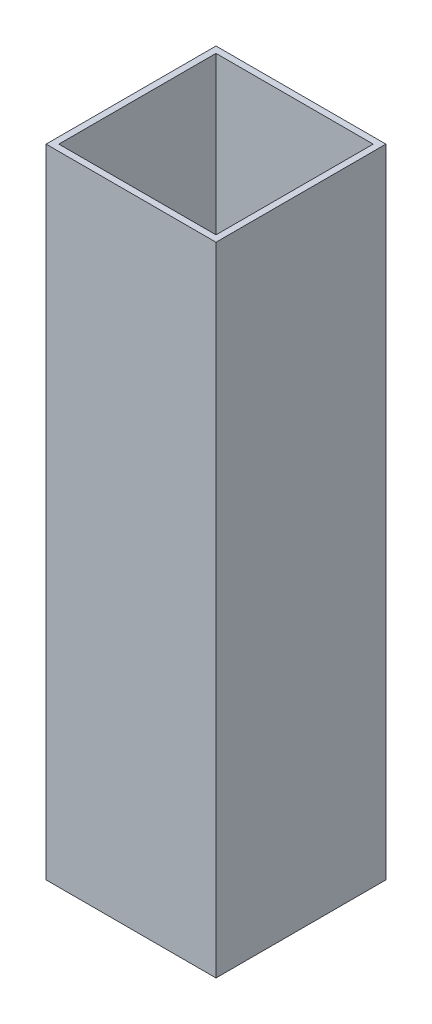
ISO-10303-21;
HEADER;
FILE_DESCRIPTION(('STEP AP214'),'2;1');
FILE_NAME('part.step','',(''),(''),'','','');
FILE_SCHEMA(('AUTOMOTIVE_DESIGN { 1 0 10303 214 1 1 1 1 }'));
ENDSEC;
DATA;
#1=APPLICATION_CONTEXT('core data for automotive mechanical design processes');
#2=APPLICATION_PROTOCOL_DEFINITION('international standard','automotive_design',2000,#1);
#3=PRODUCT_CONTEXT('',#1,'mechanical');
#4=PRODUCT('Part','Part','',(#3));
#5=PRODUCT_RELATED_PRODUCT_CATEGORY('part','',(#4));
#6=PRODUCT_DEFINITION_FORMATION('','',#4);
#7=PRODUCT_DEFINITION_CONTEXT('part definition',#1,'design');
#8=PRODUCT_DEFINITION('design','',#6,#7);
#9=PRODUCT_DEFINITION_SHAPE('','',#8);
#10=(LENGTH_UNIT() NAMED_UNIT(*) SI_UNIT(.MILLI.,.METRE.));
#11=(NAMED_UNIT(*) PLANE_ANGLE_UNIT() SI_UNIT($,.RADIAN.));
#12=(NAMED_UNIT(*) SI_UNIT($,.STERADIAN.) SOLID_ANGLE_UNIT());
#13=UNCERTAINTY_MEASURE_WITH_UNIT(LENGTH_MEASURE(1.E-05),#10,'distance_accuracy_value','');
#14=(GEOMETRIC_REPRESENTATION_CONTEXT(3) GLOBAL_UNCERTAINTY_ASSIGNED_CONTEXT((#13)) GLOBAL_UNIT_ASSIGNED_CONTEXT((#10,
#11,#12)) REPRESENTATION_CONTEXT('',''));
#15=CARTESIAN_POINT('',(0.,0.,0.));
#16=DIRECTION('',(0.,0.,1.));
#17=DIRECTION('',(1.,0.,0.));
#18=AXIS2_PLACEMENT_3D('',#15,#16,#17);
#19=CARTESIAN_POINT('',(20.,150.,20.));
#20=DIRECTION('',(-1.,0.,0.));
#21=DIRECTION('',(0.,0.,1.));
#22=AXIS2_PLACEMENT_3D('',#19,#20,#21);
#23=PLANE('',#22);
#24=DIRECTION('',(0.,0.,-1.));
#25=VECTOR('',#24,1.);
#26=CARTESIAN_POINT('',(20.,0.,20.));
#27=LINE('',#26,#25);
#28=CARTESIAN_POINT('',(20.,0.,20.));
#29=VERTEX_POINT('',#28);
#30=CARTESIAN_POINT('',(20.,0.,-20.));
#31=VERTEX_POINT('',#30);
#32=EDGE_CURVE('E147',#29,#31,#27,.T.);
#33=ORIENTED_EDGE('',*,*,#32,.T.);
#34=DIRECTION('',(0.,-1.,0.));
#35=VECTOR('',#34,1.);
#36=CARTESIAN_POINT('',(20.,150.,-20.));
#37=LINE('',#36,#35);
#38=CARTESIAN_POINT('',(20.,150.,-20.));
#39=VERTEX_POINT('',#38);
#40=EDGE_CURVE('E11',#39,#31,#37,.T.);
#41=ORIENTED_EDGE('',*,*,#40,.F.);
#42=DIRECTION('',(0.,0.,-1.));
#43=VECTOR('',#42,1.);
#44=CARTESIAN_POINT('',(20.,150.,20.));
#45=LINE('',#44,#43);
#46=CARTESIAN_POINT('',(20.,150.,20.));
#47=VERTEX_POINT('',#46);
#48=EDGE_CURVE('E153',#47,#39,#45,.T.);
#49=ORIENTED_EDGE('',*,*,#48,.F.);
#50=DIRECTION('',(0.,-1.,0.));
#51=VECTOR('',#50,1.);
#52=CARTESIAN_POINT('',(20.,150.,20.));
#53=LINE('',#52,#51);
#54=EDGE_CURVE('E167',#47,#29,#53,.T.);
#55=ORIENTED_EDGE('',*,*,#54,.T.);
#56=EDGE_LOOP('',(#33,#41,#49,#55));
#57=FACE_BOUND('',#56,.T.);
#58=ADVANCED_FACE('F39',(#57),#23,.F.);
#59=CARTESIAN_POINT('',(-20.,150.,-20.));
#60=DIRECTION('',(0.,0.,1.));
#61=DIRECTION('',(1.,0.,0.));
#62=AXIS2_PLACEMENT_3D('',#59,#60,#61);
#63=PLANE('',#62);
#64=DIRECTION('',(-1.,0.,0.));
#65=VECTOR('',#64,1.);
#66=CARTESIAN_POINT('',(-20.,0.,-20.));
#67=LINE('',#66,#65);
#68=CARTESIAN_POINT('',(-20.,0.,-20.));
#69=VERTEX_POINT('',#68);
#70=EDGE_CURVE('E171',#31,#69,#67,.T.);
#71=ORIENTED_EDGE('',*,*,#70,.T.);
#72=DIRECTION('',(0.,-1.,0.));
#73=VECTOR('',#72,1.);
#74=CARTESIAN_POINT('',(-20.,150.,-20.));
#75=LINE('',#74,#73);
#76=CARTESIAN_POINT('',(-20.,150.,-20.));
#77=VERTEX_POINT('',#76);
#78=EDGE_CURVE('E47',#77,#69,#75,.T.);
#79=ORIENTED_EDGE('',*,*,#78,.F.);
#80=DIRECTION('',(-1.,0.,0.));
#81=VECTOR('',#80,1.);
#82=CARTESIAN_POINT('',(-20.,150.,-20.));
#83=LINE('',#82,#81);
#84=EDGE_CURVE('E157',#39,#77,#83,.T.);
#85=ORIENTED_EDGE('',*,*,#84,.F.);
#86=ORIENTED_EDGE('',*,*,#40,.T.);
#87=EDGE_LOOP('',(#71,#79,#85,#86));
#88=FACE_BOUND('',#87,.T.);
#89=ADVANCED_FACE('F205',(#88),#63,.F.);
#90=CARTESIAN_POINT('',(-20.,150.,20.));
#91=DIRECTION('',(1.,0.,0.));
#92=DIRECTION('',(0.,0.,-1.));
#93=AXIS2_PLACEMENT_3D('',#90,#91,#92);
#94=PLANE('',#93);
#95=DIRECTION('',(0.,0.,1.));
#96=VECTOR('',#95,1.);
#97=CARTESIAN_POINT('',(-20.,0.,20.));
#98=LINE('',#97,#96);
#99=CARTESIAN_POINT('',(-20.,0.,20.));
#100=VERTEX_POINT('',#99);
#101=EDGE_CURVE('E174',#69,#100,#98,.T.);
#102=ORIENTED_EDGE('',*,*,#101,.T.);
#103=DIRECTION('',(0.,-1.,0.));
#104=VECTOR('',#103,1.);
#105=CARTESIAN_POINT('',(-20.,150.,20.));
#106=LINE('',#105,#104);
#107=CARTESIAN_POINT('',(-20.,150.,20.));
#108=VERTEX_POINT('',#107);
#109=EDGE_CURVE('E182',#108,#100,#106,.T.);
#110=ORIENTED_EDGE('',*,*,#109,.F.);
#111=DIRECTION('',(0.,0.,1.));
#112=VECTOR('',#111,1.);
#113=CARTESIAN_POINT('',(-20.,150.,20.));
#114=LINE('',#113,#112);
#115=EDGE_CURVE('E161',#77,#108,#114,.T.);
#116=ORIENTED_EDGE('',*,*,#115,.F.);
#117=ORIENTED_EDGE('',*,*,#78,.T.);
#118=EDGE_LOOP('',(#102,#110,#116,#117));
#119=FACE_BOUND('',#118,.T.);
#120=ADVANCED_FACE('F191',(#119),#94,.F.);
#121=CARTESIAN_POINT('',(-20.,150.,20.));
#122=DIRECTION('',(0.,0.,-1.));
#123=DIRECTION('',(-1.,0.,0.));
#124=AXIS2_PLACEMENT_3D('',#121,#122,#123);
#125=PLANE('',#124);
#126=DIRECTION('',(1.,0.,0.));
#127=VECTOR('',#126,1.);
#128=CARTESIAN_POINT('',(-20.,0.,20.));
#129=LINE('',#128,#127);
#130=EDGE_CURVE('E158',#100,#29,#129,.T.);
#131=ORIENTED_EDGE('',*,*,#130,.T.);
#132=ORIENTED_EDGE('',*,*,#54,.F.);
#133=DIRECTION('',(1.,0.,0.));
#134=VECTOR('',#133,1.);
#135=CARTESIAN_POINT('',(-20.,150.,20.));
#136=LINE('',#135,#134);
#137=EDGE_CURVE('E164',#108,#47,#136,.T.);
#138=ORIENTED_EDGE('',*,*,#137,.F.);
#139=ORIENTED_EDGE('',*,*,#109,.T.);
#140=EDGE_LOOP('',(#131,#132,#138,#139));
#141=FACE_BOUND('',#140,.T.);
#142=ADVANCED_FACE('F200',(#141),#125,.F.);
#143=CARTESIAN_POINT('',(0.,150.,0.));
#144=DIRECTION('',(0.,-1.,0.));
#145=DIRECTION('',(0.,0.,-1.));
#146=AXIS2_PLACEMENT_3D('',#143,#144,#145);
#147=PLANE('',#146);
#148=DIRECTION('',(1.,0.,0.));
#149=VECTOR('',#148,1.);
#150=CARTESIAN_POINT('',(-18.5,150.,-18.5));
#151=LINE('',#150,#149);
#152=CARTESIAN_POINT('',(-18.5,150.,-18.5));
#153=VERTEX_POINT('',#152);
#154=CARTESIAN_POINT('',(18.5,150.,-18.5));
#155=VERTEX_POINT('',#154);
#156=EDGE_CURVE('E113',#153,#155,#151,.T.);
#157=ORIENTED_EDGE('',*,*,#156,.T.);
#158=DIRECTION('',(0.,0.,1.));
#159=VECTOR('',#158,1.);
#160=CARTESIAN_POINT('',(18.5,150.,-18.5));
#161=LINE('',#160,#159);
#162=CARTESIAN_POINT('',(18.5,150.,18.5));
#163=VERTEX_POINT('',#162);
#164=EDGE_CURVE('E106',#155,#163,#161,.T.);
#165=ORIENTED_EDGE('',*,*,#164,.T.);
#166=DIRECTION('',(-1.,0.,0.));
#167=VECTOR('',#166,1.);
#168=CARTESIAN_POINT('',(-18.5,150.,18.5));
#169=LINE('',#168,#167);
#170=CARTESIAN_POINT('',(-18.5,150.,18.5));
#171=VERTEX_POINT('',#170);
#172=EDGE_CURVE('E116',#163,#171,#169,.T.);
#173=ORIENTED_EDGE('',*,*,#172,.T.);
#174=DIRECTION('',(0.,0.,-1.));
#175=VECTOR('',#174,1.);
#176=CARTESIAN_POINT('',(-18.5,150.,-18.5));
#177=LINE('',#176,#175);
#178=EDGE_CURVE('E54',#171,#153,#177,.T.);
#179=ORIENTED_EDGE('',*,*,#178,.T.);
#180=EDGE_LOOP('',(#157,#165,#173,#179));
#181=FACE_BOUND('',#180,.T.);
#182=ORIENTED_EDGE('',*,*,#48,.T.);
#183=ORIENTED_EDGE('',*,*,#84,.T.);
#184=ORIENTED_EDGE('',*,*,#115,.T.);
#185=ORIENTED_EDGE('',*,*,#137,.T.);
#186=EDGE_LOOP('',(#182,#183,#184,#185));
#187=FACE_BOUND('',#186,.T.);
#188=ADVANCED_FACE('F121',(#181,#187),#147,.F.);
#189=CARTESIAN_POINT('',(0.,0.,0.));
#190=DIRECTION('',(0.,-1.,0.));
#191=DIRECTION('',(0.,0.,-1.));
#192=AXIS2_PLACEMENT_3D('',#189,#190,#191);
#193=PLANE('',#192);
#194=DIRECTION('',(0.,0.,1.));
#195=VECTOR('',#194,1.);
#196=CARTESIAN_POINT('',(18.5,0.,-18.5));
#197=LINE('',#196,#195);
#198=CARTESIAN_POINT('',(18.5,0.,-18.5));
#199=VERTEX_POINT('',#198);
#200=CARTESIAN_POINT('',(18.5,0.,18.5));
#201=VERTEX_POINT('',#200);
#202=EDGE_CURVE('E62',#199,#201,#197,.T.);
#203=ORIENTED_EDGE('',*,*,#202,.F.);
#204=DIRECTION('',(1.,0.,0.));
#205=VECTOR('',#204,1.);
#206=CARTESIAN_POINT('',(-18.5,0.,-18.5));
#207=LINE('',#206,#205);
#208=CARTESIAN_POINT('',(-18.5,0.,-18.5));
#209=VERTEX_POINT('',#208);
#210=EDGE_CURVE('E125',#209,#199,#207,.T.);
#211=ORIENTED_EDGE('',*,*,#210,.F.);
#212=DIRECTION('',(0.,0.,-1.));
#213=VECTOR('',#212,1.);
#214=CARTESIAN_POINT('',(-18.5,0.,-18.5));
#215=LINE('',#214,#213);
#216=CARTESIAN_POINT('',(-18.5,0.,18.5));
#217=VERTEX_POINT('',#216);
#218=EDGE_CURVE('E129',#217,#209,#215,.T.);
#219=ORIENTED_EDGE('',*,*,#218,.F.);
#220=DIRECTION('',(-1.,0.,0.));
#221=VECTOR('',#220,1.);
#222=CARTESIAN_POINT('',(-18.5,0.,18.5));
#223=LINE('',#222,#221);
#224=EDGE_CURVE('E138',#201,#217,#223,.T.);
#225=ORIENTED_EDGE('',*,*,#224,.F.);
#226=EDGE_LOOP('',(#203,#211,#219,#225));
#227=FACE_BOUND('',#226,.T.);
#228=ORIENTED_EDGE('',*,*,#32,.F.);
#229=ORIENTED_EDGE('',*,*,#130,.F.);
#230=ORIENTED_EDGE('',*,*,#101,.F.);
#231=ORIENTED_EDGE('',*,*,#70,.F.);
#232=EDGE_LOOP('',(#228,#229,#230,#231));
#233=FACE_BOUND('',#232,.T.);
#234=ADVANCED_FACE('F197',(#227,#233),#193,.T.);
#235=CARTESIAN_POINT('',(18.5,150.,-18.5));
#236=DIRECTION('',(1.,0.,0.));
#237=DIRECTION('',(0.,0.,-1.));
#238=AXIS2_PLACEMENT_3D('',#235,#236,#237);
#239=PLANE('',#238);
#240=ORIENTED_EDGE('',*,*,#202,.T.);
#241=DIRECTION('',(0.,-1.,0.));
#242=VECTOR('',#241,1.);
#243=CARTESIAN_POINT('',(18.5,150.,18.5));
#244=LINE('',#243,#242);
#245=EDGE_CURVE('E102',#163,#201,#244,.T.);
#246=ORIENTED_EDGE('',*,*,#245,.F.);
#247=ORIENTED_EDGE('',*,*,#164,.F.);
#248=DIRECTION('',(0.,-1.,0.));
#249=VECTOR('',#248,1.);
#250=CARTESIAN_POINT('',(18.5,150.,-18.5));
#251=LINE('',#250,#249);
#252=EDGE_CURVE('E144',#155,#199,#251,.T.);
#253=ORIENTED_EDGE('',*,*,#252,.T.);
#254=EDGE_LOOP('',(#240,#246,#247,#253));
#255=FACE_BOUND('',#254,.T.);
#256=ADVANCED_FACE('F104',(#255),#239,.F.);
#257=CARTESIAN_POINT('',(-18.5,150.,-18.5));
#258=DIRECTION('',(0.,0.,-1.));
#259=DIRECTION('',(-1.,0.,0.));
#260=AXIS2_PLACEMENT_3D('',#257,#258,#259);
#261=PLANE('',#260);
#262=ORIENTED_EDGE('',*,*,#210,.T.);
#263=ORIENTED_EDGE('',*,*,#252,.F.);
#264=ORIENTED_EDGE('',*,*,#156,.F.);
#265=DIRECTION('',(0.,-1.,0.));
#266=VECTOR('',#265,1.);
#267=CARTESIAN_POINT('',(-18.5,150.,-18.5));
#268=LINE('',#267,#266);
#269=EDGE_CURVE('E148',#153,#209,#268,.T.);
#270=ORIENTED_EDGE('',*,*,#269,.T.);
#271=EDGE_LOOP('',(#262,#263,#264,#270));
#272=FACE_BOUND('',#271,.T.);
#273=ADVANCED_FACE('F222',(#272),#261,.F.);
#274=CARTESIAN_POINT('',(-18.5,150.,-18.5));
#275=DIRECTION('',(-1.,0.,0.));
#276=DIRECTION('',(0.,0.,1.));
#277=AXIS2_PLACEMENT_3D('',#274,#275,#276);
#278=PLANE('',#277);
#279=ORIENTED_EDGE('',*,*,#218,.T.);
#280=ORIENTED_EDGE('',*,*,#269,.F.);
#281=ORIENTED_EDGE('',*,*,#178,.F.);
#282=DIRECTION('',(0.,-1.,0.));
#283=VECTOR('',#282,1.);
#284=CARTESIAN_POINT('',(-18.5,150.,18.5));
#285=LINE('',#284,#283);
#286=EDGE_CURVE('E112',#171,#217,#285,.T.);
#287=ORIENTED_EDGE('',*,*,#286,.T.);
#288=EDGE_LOOP('',(#279,#280,#281,#287));
#289=FACE_BOUND('',#288,.T.);
#290=ADVANCED_FACE('F225',(#289),#278,.F.);
#291=CARTESIAN_POINT('',(-18.5,150.,18.5));
#292=DIRECTION('',(0.,0.,1.));
#293=DIRECTION('',(1.,0.,0.));
#294=AXIS2_PLACEMENT_3D('',#291,#292,#293);
#295=PLANE('',#294);
#296=ORIENTED_EDGE('',*,*,#224,.T.);
#297=ORIENTED_EDGE('',*,*,#286,.F.);
#298=ORIENTED_EDGE('',*,*,#172,.F.);
#299=ORIENTED_EDGE('',*,*,#245,.T.);
#300=EDGE_LOOP('',(#296,#297,#298,#299));
#301=FACE_BOUND('',#300,.T.);
#302=ADVANCED_FACE('F117',(#301),#295,.F.);
#303=CLOSED_SHELL('',(#58,#89,#120,#142,#188,#234,#256,#273,#290,#302));
#304=MANIFOLD_SOLID_BREP('B2',#303);
#305=ADVANCED_BREP_SHAPE_REPRESENTATION('',(#18,#304),#14);
#306=SHAPE_DEFINITION_REPRESENTATION(#9,#305);
ENDSEC;
END-ISO-10303-21;
